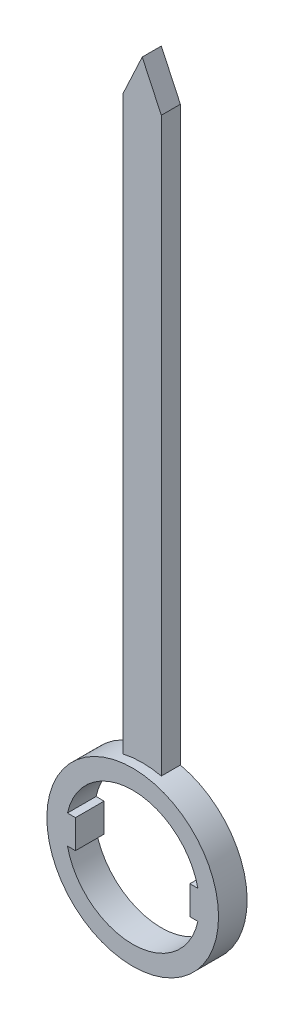
ISO-10303-21;
HEADER;
FILE_DESCRIPTION(('STEP AP214'),'2;1');
FILE_NAME('part.step','',(''),(''),'','','');
FILE_SCHEMA(('AUTOMOTIVE_DESIGN { 1 0 10303 214 1 1 1 1 }'));
ENDSEC;
DATA;
#1=APPLICATION_CONTEXT('core data for automotive mechanical design processes');
#2=APPLICATION_PROTOCOL_DEFINITION('international standard','automotive_design',2000,#1);
#3=PRODUCT_CONTEXT('',#1,'mechanical');
#4=PRODUCT('Part','Part','',(#3));
#5=PRODUCT_RELATED_PRODUCT_CATEGORY('part','',(#4));
#6=PRODUCT_DEFINITION_FORMATION('','',#4);
#7=PRODUCT_DEFINITION_CONTEXT('part definition',#1,'design');
#8=PRODUCT_DEFINITION('design','',#6,#7);
#9=PRODUCT_DEFINITION_SHAPE('','',#8);
#10=(LENGTH_UNIT() NAMED_UNIT(*) SI_UNIT(.MILLI.,.METRE.));
#11=(NAMED_UNIT(*) PLANE_ANGLE_UNIT() SI_UNIT($,.RADIAN.));
#12=(NAMED_UNIT(*) SI_UNIT($,.STERADIAN.) SOLID_ANGLE_UNIT());
#13=UNCERTAINTY_MEASURE_WITH_UNIT(LENGTH_MEASURE(1.E-05),#10,'distance_accuracy_value','');
#14=(GEOMETRIC_REPRESENTATION_CONTEXT(3) GLOBAL_UNCERTAINTY_ASSIGNED_CONTEXT((#13)) GLOBAL_UNIT_ASSIGNED_CONTEXT((#10,
#11,#12)) REPRESENTATION_CONTEXT('',''));
#15=CARTESIAN_POINT('',(0.,0.,0.));
#16=DIRECTION('',(0.,0.,1.));
#17=DIRECTION('',(1.,0.,0.));
#18=AXIS2_PLACEMENT_3D('',#15,#16,#17);
#19=CARTESIAN_POINT('',(0.,0.,3.));
#20=DIRECTION('',(0.,0.,-1.));
#21=DIRECTION('',(-1.,0.,0.));
#22=AXIS2_PLACEMENT_3D('',#19,#20,#21);
#23=CYLINDRICAL_SURFACE('',#22,9.);
#24=CARTESIAN_POINT('',(0.,0.,3.));
#25=DIRECTION('',(0.,0.,1.));
#26=DIRECTION('',(1.,0.,0.));
#27=AXIS2_PLACEMENT_3D('',#24,#25,#26);
#28=CIRCLE('',#27,9.);
#29=CARTESIAN_POINT('',(9.,0.,3.));
#30=VERTEX_POINT('',#29);
#31=EDGE_CURVE('E192',#30,#30,#28,.T.);
#32=ORIENTED_EDGE('',*,*,#31,.F.);
#33=EDGE_LOOP('',(#32));
#34=FACE_BOUND('',#33,.T.);
#35=DIRECTION('',(0.,0.,-1.));
#36=VECTOR('',#35,1.);
#37=CARTESIAN_POINT('',(2.,8.77496438739212,2.));
#38=LINE('',#37,#36);
#39=CARTESIAN_POINT('',(2.,8.77496438739212,2.));
#40=VERTEX_POINT('',#39);
#41=CARTESIAN_POINT('',(2.,8.77496438739212,0.));
#42=VERTEX_POINT('',#41);
#43=EDGE_CURVE('E50',#40,#42,#38,.T.);
#44=ORIENTED_EDGE('',*,*,#43,.F.);
#45=CARTESIAN_POINT('',(0.,0.,2.));
#46=DIRECTION('',(0.,0.,-1.));
#47=DIRECTION('',(-1.,0.,0.));
#48=AXIS2_PLACEMENT_3D('',#45,#46,#47);
#49=CIRCLE('',#48,9.);
#50=CARTESIAN_POINT('',(-2.,8.77496438739212,2.));
#51=VERTEX_POINT('',#50);
#52=EDGE_CURVE('E55',#51,#40,#49,.T.);
#53=ORIENTED_EDGE('',*,*,#52,.F.);
#54=DIRECTION('',(0.,0.,-1.));
#55=VECTOR('',#54,1.);
#56=CARTESIAN_POINT('',(-2.,8.77496438739212,2.));
#57=LINE('',#56,#55);
#58=CARTESIAN_POINT('',(-2.,8.77496438739212,0.));
#59=VERTEX_POINT('',#58);
#60=EDGE_CURVE('E149',#51,#59,#57,.T.);
#61=ORIENTED_EDGE('',*,*,#60,.T.);
#62=CARTESIAN_POINT('',(0.,0.,0.));
#63=DIRECTION('',(0.,0.,1.));
#64=DIRECTION('',(1.,0.,0.));
#65=AXIS2_PLACEMENT_3D('',#62,#63,#64);
#66=CIRCLE('',#65,9.);
#67=EDGE_CURVE('E176',#59,#42,#66,.T.);
#68=ORIENTED_EDGE('',*,*,#67,.T.);
#69=EDGE_LOOP('',(#44,#53,#61,#68));
#70=FACE_BOUND('',#69,.T.);
#71=ADVANCED_FACE('F35',(#34,#70),#23,.T.);
#72=CARTESIAN_POINT('',(0.,0.,3.));
#73=DIRECTION('',(0.,0.,-1.));
#74=DIRECTION('',(-1.,0.,0.));
#75=AXIS2_PLACEMENT_3D('',#72,#73,#74);
#76=CYLINDRICAL_SURFACE('',#75,7.);
#77=CARTESIAN_POINT('',(0.,0.,0.));
#78=DIRECTION('',(0.,0.,1.));
#79=DIRECTION('',(1.,0.,0.));
#80=AXIS2_PLACEMENT_3D('',#77,#78,#79);
#81=CIRCLE('',#80,7.);
#82=CARTESIAN_POINT('',(6.83739716558867,1.5,0.));
#83=VERTEX_POINT('',#82);
#84=CARTESIAN_POINT('',(-6.83739716558867,1.5,0.));
#85=VERTEX_POINT('',#84);
#86=EDGE_CURVE('E166',#83,#85,#81,.T.);
#87=ORIENTED_EDGE('',*,*,#86,.F.);
#88=DIRECTION('',(0.,0.,-1.));
#89=VECTOR('',#88,1.);
#90=CARTESIAN_POINT('',(6.83739716558867,1.5,3.));
#91=LINE('',#90,#89);
#92=CARTESIAN_POINT('',(6.83739716558867,1.5,3.));
#93=VERTEX_POINT('',#92);
#94=EDGE_CURVE('E11',#93,#83,#91,.T.);
#95=ORIENTED_EDGE('',*,*,#94,.F.);
#96=CARTESIAN_POINT('',(0.,0.,3.));
#97=DIRECTION('',(0.,0.,1.));
#98=DIRECTION('',(1.,0.,0.));
#99=AXIS2_PLACEMENT_3D('',#96,#97,#98);
#100=CIRCLE('',#99,7.);
#101=CARTESIAN_POINT('',(-6.83739716558867,1.5,3.));
#102=VERTEX_POINT('',#101);
#103=EDGE_CURVE('E172',#93,#102,#100,.T.);
#104=ORIENTED_EDGE('',*,*,#103,.T.);
#105=DIRECTION('',(0.,0.,-1.));
#106=VECTOR('',#105,1.);
#107=CARTESIAN_POINT('',(-6.83739716558867,1.5,3.));
#108=LINE('',#107,#106);
#109=EDGE_CURVE('E195',#102,#85,#108,.T.);
#110=ORIENTED_EDGE('',*,*,#109,.T.);
#111=EDGE_LOOP('',(#87,#95,#104,#110));
#112=FACE_BOUND('',#111,.T.);
#113=ADVANCED_FACE('F255',(#112),#76,.F.);
#114=CARTESIAN_POINT('',(0.,1.5,3.));
#115=DIRECTION('',(0.,-1.,0.));
#116=DIRECTION('',(1.,0.,0.));
#117=AXIS2_PLACEMENT_3D('',#114,#115,#116);
#118=PLANE('',#117);
#119=DIRECTION('',(-1.,0.,0.));
#120=VECTOR('',#119,1.);
#121=CARTESIAN_POINT('',(0.,1.5,0.));
#122=LINE('',#121,#120);
#123=CARTESIAN_POINT('',(6.,1.5,0.));
#124=VERTEX_POINT('',#123);
#125=EDGE_CURVE('E198',#83,#124,#122,.T.);
#126=ORIENTED_EDGE('',*,*,#125,.T.);
#127=DIRECTION('',(0.,0.,-1.));
#128=VECTOR('',#127,1.);
#129=CARTESIAN_POINT('',(6.,1.5,3.));
#130=LINE('',#129,#128);
#131=CARTESIAN_POINT('',(6.,1.5,3.));
#132=VERTEX_POINT('',#131);
#133=EDGE_CURVE('E43',#132,#124,#130,.T.);
#134=ORIENTED_EDGE('',*,*,#133,.F.);
#135=DIRECTION('',(-1.,0.,0.));
#136=VECTOR('',#135,1.);
#137=CARTESIAN_POINT('',(0.,1.5,3.));
#138=LINE('',#137,#136);
#139=EDGE_CURVE('E175',#93,#132,#138,.T.);
#140=ORIENTED_EDGE('',*,*,#139,.F.);
#141=ORIENTED_EDGE('',*,*,#94,.T.);
#142=EDGE_LOOP('',(#126,#134,#140,#141));
#143=FACE_BOUND('',#142,.T.);
#144=ADVANCED_FACE('F37',(#143),#118,.F.);
#145=CARTESIAN_POINT('',(6.,0.,3.));
#146=DIRECTION('',(-1.,0.,0.));
#147=DIRECTION('',(0.,-1.,0.));
#148=AXIS2_PLACEMENT_3D('',#145,#146,#147);
#149=PLANE('',#148);
#150=DIRECTION('',(0.,1.,0.));
#151=VECTOR('',#150,1.);
#152=CARTESIAN_POINT('',(6.,0.,0.));
#153=LINE('',#152,#151);
#154=CARTESIAN_POINT('',(6.,-1.5,0.));
#155=VERTEX_POINT('',#154);
#156=EDGE_CURVE('E202',#155,#124,#153,.T.);
#157=ORIENTED_EDGE('',*,*,#156,.F.);
#158=DIRECTION('',(0.,0.,-1.));
#159=VECTOR('',#158,1.);
#160=CARTESIAN_POINT('',(6.,-1.5,3.));
#161=LINE('',#160,#159);
#162=CARTESIAN_POINT('',(6.,-1.5,3.));
#163=VERTEX_POINT('',#162);
#164=EDGE_CURVE('E227',#163,#155,#161,.T.);
#165=ORIENTED_EDGE('',*,*,#164,.F.);
#166=DIRECTION('',(0.,1.,0.));
#167=VECTOR('',#166,1.);
#168=CARTESIAN_POINT('',(6.,0.,3.));
#169=LINE('',#168,#167);
#170=EDGE_CURVE('E179',#163,#132,#169,.T.);
#171=ORIENTED_EDGE('',*,*,#170,.T.);
#172=ORIENTED_EDGE('',*,*,#133,.T.);
#173=EDGE_LOOP('',(#157,#165,#171,#172));
#174=FACE_BOUND('',#173,.T.);
#175=ADVANCED_FACE('F231',(#174),#149,.T.);
#176=CARTESIAN_POINT('',(0.,-1.5,3.));
#177=DIRECTION('',(0.,-1.,0.));
#178=DIRECTION('',(1.,0.,0.));
#179=AXIS2_PLACEMENT_3D('',#176,#177,#178);
#180=PLANE('',#179);
#181=DIRECTION('',(-1.,0.,0.));
#182=VECTOR('',#181,1.);
#183=CARTESIAN_POINT('',(0.,-1.5,0.));
#184=LINE('',#183,#182);
#185=CARTESIAN_POINT('',(6.83739716558867,-1.5,0.));
#186=VERTEX_POINT('',#185);
#187=EDGE_CURVE('E205',#186,#155,#184,.T.);
#188=ORIENTED_EDGE('',*,*,#187,.F.);
#189=DIRECTION('',(0.,0.,-1.));
#190=VECTOR('',#189,1.);
#191=CARTESIAN_POINT('',(6.83739716558867,-1.5,3.));
#192=LINE('',#191,#190);
#193=CARTESIAN_POINT('',(6.83739716558867,-1.5,3.));
#194=VERTEX_POINT('',#193);
#195=EDGE_CURVE('E225',#194,#186,#192,.T.);
#196=ORIENTED_EDGE('',*,*,#195,.F.);
#197=DIRECTION('',(-1.,0.,0.));
#198=VECTOR('',#197,1.);
#199=CARTESIAN_POINT('',(0.,-1.5,3.));
#200=LINE('',#199,#198);
#201=EDGE_CURVE('E182',#194,#163,#200,.T.);
#202=ORIENTED_EDGE('',*,*,#201,.T.);
#203=ORIENTED_EDGE('',*,*,#164,.T.);
#204=EDGE_LOOP('',(#188,#196,#202,#203));
#205=FACE_BOUND('',#204,.T.);
#206=ADVANCED_FACE('F245',(#205),#180,.T.);
#207=CARTESIAN_POINT('',(-6.83739716558867,-1.5,0.));
#208=VERTEX_POINT('',#207);
#209=EDGE_CURVE('E199',#208,#186,#81,.T.);
#210=ORIENTED_EDGE('',*,*,#209,.F.);
#211=DIRECTION('',(0.,0.,-1.));
#212=VECTOR('',#211,1.);
#213=CARTESIAN_POINT('',(-6.83739716558867,-1.5,3.));
#214=LINE('',#213,#212);
#215=CARTESIAN_POINT('',(-6.83739716558867,-1.5,3.));
#216=VERTEX_POINT('',#215);
#217=EDGE_CURVE('E223',#216,#208,#214,.T.);
#218=ORIENTED_EDGE('',*,*,#217,.F.);
#219=EDGE_CURVE('E177',#216,#194,#100,.T.);
#220=ORIENTED_EDGE('',*,*,#219,.T.);
#221=ORIENTED_EDGE('',*,*,#195,.T.);
#222=EDGE_LOOP('',(#210,#218,#220,#221));
#223=FACE_BOUND('',#222,.T.);
#224=ADVANCED_FACE('F267',(#223),#76,.F.);
#225=CARTESIAN_POINT('',(0.,-1.5,3.));
#226=DIRECTION('',(0.,1.,0.));
#227=DIRECTION('',(0.,0.,1.));
#228=AXIS2_PLACEMENT_3D('',#225,#226,#227);
#229=PLANE('',#228);
#230=DIRECTION('',(1.,0.,0.));
#231=VECTOR('',#230,1.);
#232=CARTESIAN_POINT('',(0.,-1.5,0.));
#233=LINE('',#232,#231);
#234=CARTESIAN_POINT('',(-6.,-1.5,0.));
#235=VERTEX_POINT('',#234);
#236=EDGE_CURVE('E208',#208,#235,#233,.T.);
#237=ORIENTED_EDGE('',*,*,#236,.T.);
#238=DIRECTION('',(0.,0.,-1.));
#239=VECTOR('',#238,1.);
#240=CARTESIAN_POINT('',(-6.,-1.5,3.));
#241=LINE('',#240,#239);
#242=CARTESIAN_POINT('',(-6.,-1.5,3.));
#243=VERTEX_POINT('',#242);
#244=EDGE_CURVE('E220',#243,#235,#241,.T.);
#245=ORIENTED_EDGE('',*,*,#244,.F.);
#246=DIRECTION('',(1.,0.,0.));
#247=VECTOR('',#246,1.);
#248=CARTESIAN_POINT('',(0.,-1.5,3.));
#249=LINE('',#248,#247);
#250=EDGE_CURVE('E185',#216,#243,#249,.T.);
#251=ORIENTED_EDGE('',*,*,#250,.F.);
#252=ORIENTED_EDGE('',*,*,#217,.T.);
#253=EDGE_LOOP('',(#237,#245,#251,#252));
#254=FACE_BOUND('',#253,.T.);
#255=ADVANCED_FACE('F269',(#254),#229,.F.);
#256=CARTESIAN_POINT('',(-6.,0.,3.));
#257=DIRECTION('',(-1.,0.,0.));
#258=DIRECTION('',(0.,0.,1.));
#259=AXIS2_PLACEMENT_3D('',#256,#257,#258);
#260=PLANE('',#259);
#261=DIRECTION('',(0.,1.,0.));
#262=VECTOR('',#261,1.);
#263=CARTESIAN_POINT('',(-6.,0.,0.));
#264=LINE('',#263,#262);
#265=CARTESIAN_POINT('',(-6.,1.5,0.));
#266=VERTEX_POINT('',#265);
#267=EDGE_CURVE('E210',#235,#266,#264,.T.);
#268=ORIENTED_EDGE('',*,*,#267,.T.);
#269=DIRECTION('',(0.,0.,-1.));
#270=VECTOR('',#269,1.);
#271=CARTESIAN_POINT('',(-6.,1.5,3.));
#272=LINE('',#271,#270);
#273=CARTESIAN_POINT('',(-6.,1.5,3.));
#274=VERTEX_POINT('',#273);
#275=EDGE_CURVE('E218',#274,#266,#272,.T.);
#276=ORIENTED_EDGE('',*,*,#275,.F.);
#277=DIRECTION('',(0.,1.,0.));
#278=VECTOR('',#277,1.);
#279=CARTESIAN_POINT('',(-6.,0.,3.));
#280=LINE('',#279,#278);
#281=EDGE_CURVE('E187',#243,#274,#280,.T.);
#282=ORIENTED_EDGE('',*,*,#281,.F.);
#283=ORIENTED_EDGE('',*,*,#244,.T.);
#284=EDGE_LOOP('',(#268,#276,#282,#283));
#285=FACE_BOUND('',#284,.T.);
#286=ADVANCED_FACE('F263',(#285),#260,.F.);
#287=CARTESIAN_POINT('',(0.,1.5,3.));
#288=DIRECTION('',(0.,1.,0.));
#289=DIRECTION('',(0.,0.,1.));
#290=AXIS2_PLACEMENT_3D('',#287,#288,#289);
#291=PLANE('',#290);
#292=DIRECTION('',(1.,0.,0.));
#293=VECTOR('',#292,1.);
#294=CARTESIAN_POINT('',(0.,1.5,0.));
#295=LINE('',#294,#293);
#296=EDGE_CURVE('E213',#85,#266,#295,.T.);
#297=ORIENTED_EDGE('',*,*,#296,.F.);
#298=ORIENTED_EDGE('',*,*,#109,.F.);
#299=DIRECTION('',(1.,0.,0.));
#300=VECTOR('',#299,1.);
#301=CARTESIAN_POINT('',(0.,1.5,3.));
#302=LINE('',#301,#300);
#303=EDGE_CURVE('E189',#102,#274,#302,.T.);
#304=ORIENTED_EDGE('',*,*,#303,.T.);
#305=ORIENTED_EDGE('',*,*,#275,.T.);
#306=EDGE_LOOP('',(#297,#298,#304,#305));
#307=FACE_BOUND('',#306,.T.);
#308=ADVANCED_FACE('F259',(#307),#291,.T.);
#309=CARTESIAN_POINT('',(0.,0.,3.));
#310=DIRECTION('',(0.,0.,1.));
#311=DIRECTION('',(1.,0.,0.));
#312=AXIS2_PLACEMENT_3D('',#309,#310,#311);
#313=PLANE('',#312);
#314=ORIENTED_EDGE('',*,*,#103,.F.);
#315=ORIENTED_EDGE('',*,*,#139,.T.);
#316=ORIENTED_EDGE('',*,*,#170,.F.);
#317=ORIENTED_EDGE('',*,*,#201,.F.);
#318=ORIENTED_EDGE('',*,*,#219,.F.);
#319=ORIENTED_EDGE('',*,*,#250,.T.);
#320=ORIENTED_EDGE('',*,*,#281,.T.);
#321=ORIENTED_EDGE('',*,*,#303,.F.);
#322=EDGE_LOOP('',(#314,#315,#316,#317,#318,#319,#320,#321));
#323=FACE_BOUND('',#322,.T.);
#324=ORIENTED_EDGE('',*,*,#31,.T.);
#325=EDGE_LOOP('',(#324));
#326=FACE_BOUND('',#325,.T.);
#327=ADVANCED_FACE('F249',(#323,#326),#313,.T.);
#328=CARTESIAN_POINT('',(0.,0.,0.));
#329=DIRECTION('',(0.,0.,1.));
#330=DIRECTION('',(1.,0.,0.));
#331=AXIS2_PLACEMENT_3D('',#328,#329,#330);
#332=PLANE('',#331);
#333=ORIENTED_EDGE('',*,*,#86,.T.);
#334=ORIENTED_EDGE('',*,*,#296,.T.);
#335=ORIENTED_EDGE('',*,*,#267,.F.);
#336=ORIENTED_EDGE('',*,*,#236,.F.);
#337=ORIENTED_EDGE('',*,*,#209,.T.);
#338=ORIENTED_EDGE('',*,*,#187,.T.);
#339=ORIENTED_EDGE('',*,*,#156,.T.);
#340=ORIENTED_EDGE('',*,*,#125,.F.);
#341=EDGE_LOOP('',(#333,#334,#335,#336,#337,#338,#339,#340));
#342=FACE_BOUND('',#341,.T.);
#343=ORIENTED_EDGE('',*,*,#67,.F.);
#344=DIRECTION('',(0.,-1.,0.));
#345=VECTOR('',#344,1.);
#346=CARTESIAN_POINT('',(-2.,0.,0.));
#347=LINE('',#346,#345);
#348=CARTESIAN_POINT('',(-1.99999999999999,68.7749643873921,0.));
#349=VERTEX_POINT('',#348);
#350=EDGE_CURVE('E159',#349,#59,#347,.T.);
#351=ORIENTED_EDGE('',*,*,#350,.F.);
#352=DIRECTION('',(-0.422618261740701,-0.906307787036649,0.));
#353=VECTOR('',#352,1.);
#354=CARTESIAN_POINT('',(-27.9851272570203,13.0496791543908,0.));
#355=LINE('',#354,#353);
#356=CARTESIAN_POINT('',(0.,73.0639782284112,0.));
#357=VERTEX_POINT('',#356);
#358=EDGE_CURVE('E144',#357,#349,#355,.T.);
#359=ORIENTED_EDGE('',*,*,#358,.F.);
#360=DIRECTION('',(-0.4226182617407,0.90630778703665,0.));
#361=VECTOR('',#360,1.);
#362=CARTESIAN_POINT('',(27.9851272570202,13.0496791543907,0.));
#363=LINE('',#362,#361);
#364=CARTESIAN_POINT('',(2.,68.7749643873921,0.));
#365=VERTEX_POINT('',#364);
#366=EDGE_CURVE('E162',#365,#357,#363,.T.);
#367=ORIENTED_EDGE('',*,*,#366,.F.);
#368=DIRECTION('',(0.,1.,0.));
#369=VECTOR('',#368,1.);
#370=CARTESIAN_POINT('',(2.,0.,0.));
#371=LINE('',#370,#369);
#372=EDGE_CURVE('E153',#42,#365,#371,.T.);
#373=ORIENTED_EDGE('',*,*,#372,.F.);
#374=EDGE_LOOP('',(#343,#351,#359,#367,#373));
#375=FACE_BOUND('',#374,.T.);
#376=ADVANCED_FACE('F238',(#342,#375),#332,.F.);
#377=CARTESIAN_POINT('',(2.,0.,2.));
#378=DIRECTION('',(-1.,0.,0.));
#379=DIRECTION('',(0.,-1.,0.));
#380=AXIS2_PLACEMENT_3D('',#377,#378,#379);
#381=PLANE('',#380);
#382=ORIENTED_EDGE('',*,*,#372,.T.);
#383=DIRECTION('',(0.,0.,-1.));
#384=VECTOR('',#383,1.);
#385=CARTESIAN_POINT('',(2.,68.7749643873921,2.));
#386=LINE('',#385,#384);
#387=CARTESIAN_POINT('',(2.,68.7749643873921,2.));
#388=VERTEX_POINT('',#387);
#389=EDGE_CURVE('E167',#388,#365,#386,.T.);
#390=ORIENTED_EDGE('',*,*,#389,.F.);
#391=DIRECTION('',(0.,1.,0.));
#392=VECTOR('',#391,1.);
#393=CARTESIAN_POINT('',(2.,0.,2.));
#394=LINE('',#393,#392);
#395=EDGE_CURVE('E157',#40,#388,#394,.T.);
#396=ORIENTED_EDGE('',*,*,#395,.F.);
#397=ORIENTED_EDGE('',*,*,#43,.T.);
#398=EDGE_LOOP('',(#382,#390,#396,#397));
#399=FACE_BOUND('',#398,.T.);
#400=ADVANCED_FACE('F295',(#399),#381,.F.);
#401=CARTESIAN_POINT('',(27.9851272570202,13.0496791543907,2.));
#402=DIRECTION('',(-0.90630778703665,-0.4226182617407,0.));
#403=DIRECTION('',(0.4226182617407,-0.90630778703665,0.));
#404=AXIS2_PLACEMENT_3D('',#401,#402,#403);
#405=PLANE('',#404);
#406=ORIENTED_EDGE('',*,*,#366,.T.);
#407=DIRECTION('',(0.,0.,-1.));
#408=VECTOR('',#407,1.);
#409=CARTESIAN_POINT('',(0.,73.0639782284112,2.));
#410=LINE('',#409,#408);
#411=CARTESIAN_POINT('',(0.,73.0639782284112,2.));
#412=VERTEX_POINT('',#411);
#413=EDGE_CURVE('E148',#412,#357,#410,.T.);
#414=ORIENTED_EDGE('',*,*,#413,.F.);
#415=DIRECTION('',(-0.4226182617407,0.90630778703665,0.));
#416=VECTOR('',#415,1.);
#417=CARTESIAN_POINT('',(27.9851272570202,13.0496791543907,2.));
#418=LINE('',#417,#416);
#419=EDGE_CURVE('E135',#388,#412,#418,.T.);
#420=ORIENTED_EDGE('',*,*,#419,.F.);
#421=ORIENTED_EDGE('',*,*,#389,.T.);
#422=EDGE_LOOP('',(#406,#414,#420,#421));
#423=FACE_BOUND('',#422,.T.);
#424=ADVANCED_FACE('F301',(#423),#405,.F.);
#425=CARTESIAN_POINT('',(-27.9851272570203,13.0496791543908,2.));
#426=DIRECTION('',(0.906307787036649,-0.422618261740701,0.));
#427=DIRECTION('',(0.422618261740701,0.906307787036649,0.));
#428=AXIS2_PLACEMENT_3D('',#425,#426,#427);
#429=PLANE('',#428);
#430=ORIENTED_EDGE('',*,*,#358,.T.);
#431=DIRECTION('',(0.,0.,-1.));
#432=VECTOR('',#431,1.);
#433=CARTESIAN_POINT('',(-1.99999999999999,68.7749643873921,2.));
#434=LINE('',#433,#432);
#435=CARTESIAN_POINT('',(-1.99999999999999,68.7749643873921,2.));
#436=VERTEX_POINT('',#435);
#437=EDGE_CURVE('E141',#436,#349,#434,.T.);
#438=ORIENTED_EDGE('',*,*,#437,.F.);
#439=DIRECTION('',(-0.422618261740701,-0.906307787036649,0.));
#440=VECTOR('',#439,1.);
#441=CARTESIAN_POINT('',(-27.9851272570203,13.0496791543908,2.));
#442=LINE('',#441,#440);
#443=EDGE_CURVE('E128',#412,#436,#442,.T.);
#444=ORIENTED_EDGE('',*,*,#443,.F.);
#445=ORIENTED_EDGE('',*,*,#413,.T.);
#446=EDGE_LOOP('',(#430,#438,#444,#445));
#447=FACE_BOUND('',#446,.T.);
#448=ADVANCED_FACE('F142',(#447),#429,.F.);
#449=CARTESIAN_POINT('',(-2.,0.,2.));
#450=DIRECTION('',(1.,0.,0.));
#451=DIRECTION('',(0.,1.,0.));
#452=AXIS2_PLACEMENT_3D('',#449,#450,#451);
#453=PLANE('',#452);
#454=ORIENTED_EDGE('',*,*,#350,.T.);
#455=ORIENTED_EDGE('',*,*,#60,.F.);
#456=DIRECTION('',(0.,-1.,0.));
#457=VECTOR('',#456,1.);
#458=CARTESIAN_POINT('',(-2.,0.,2.));
#459=LINE('',#458,#457);
#460=EDGE_CURVE('E132',#436,#51,#459,.T.);
#461=ORIENTED_EDGE('',*,*,#460,.F.);
#462=ORIENTED_EDGE('',*,*,#437,.T.);
#463=EDGE_LOOP('',(#454,#455,#461,#462));
#464=FACE_BOUND('',#463,.T.);
#465=ADVANCED_FACE('F151',(#464),#453,.F.);
#466=CARTESIAN_POINT('',(0.,0.,2.));
#467=DIRECTION('',(0.,0.,-1.));
#468=DIRECTION('',(-1.,0.,0.));
#469=AXIS2_PLACEMENT_3D('',#466,#467,#468);
#470=PLANE('',#469);
#471=ORIENTED_EDGE('',*,*,#52,.T.);
#472=ORIENTED_EDGE('',*,*,#395,.T.);
#473=ORIENTED_EDGE('',*,*,#419,.T.);
#474=ORIENTED_EDGE('',*,*,#443,.T.);
#475=ORIENTED_EDGE('',*,*,#460,.T.);
#476=EDGE_LOOP('',(#471,#472,#473,#474,#475));
#477=FACE_BOUND('',#476,.T.);
#478=ADVANCED_FACE('F130',(#477),#470,.F.);
#479=CLOSED_SHELL('',(#71,#113,#144,#175,#206,#224,#255,#286,#308,#327,#376,#400,#424,#448,#465,#478));
#480=MANIFOLD_SOLID_BREP('B2',#479);
#481=ADVANCED_BREP_SHAPE_REPRESENTATION('',(#18,#480),#14);
#482=SHAPE_DEFINITION_REPRESENTATION(#9,#481);
ENDSEC;
END-ISO-10303-21;
